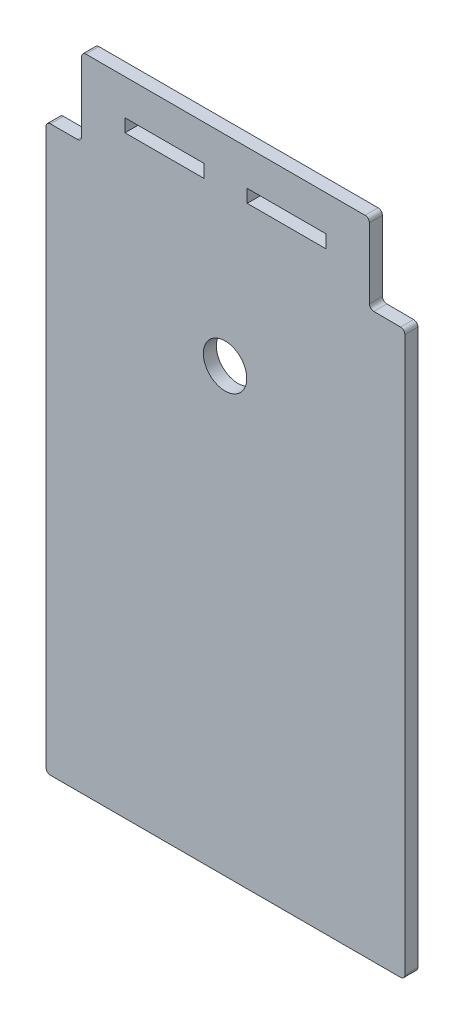
ISO-10303-21;
HEADER;
FILE_DESCRIPTION(('STEP AP214'),'2;1');
FILE_NAME('part.step','',(''),(''),'','','');
FILE_SCHEMA(('AUTOMOTIVE_DESIGN { 1 0 10303 214 1 1 1 1 }'));
ENDSEC;
DATA;
#1=APPLICATION_CONTEXT('core data for automotive mechanical design processes');
#2=APPLICATION_PROTOCOL_DEFINITION('international standard','automotive_design',2000,#1);
#3=PRODUCT_CONTEXT('',#1,'mechanical');
#4=PRODUCT('Part','Part','',(#3));
#5=PRODUCT_RELATED_PRODUCT_CATEGORY('part','',(#4));
#6=PRODUCT_DEFINITION_FORMATION('','',#4);
#7=PRODUCT_DEFINITION_CONTEXT('part definition',#1,'design');
#8=PRODUCT_DEFINITION('design','',#6,#7);
#9=PRODUCT_DEFINITION_SHAPE('','',#8);
#10=(LENGTH_UNIT() NAMED_UNIT(*) SI_UNIT(.MILLI.,.METRE.));
#11=(NAMED_UNIT(*) PLANE_ANGLE_UNIT() SI_UNIT($,.RADIAN.));
#12=(NAMED_UNIT(*) SI_UNIT($,.STERADIAN.) SOLID_ANGLE_UNIT());
#13=UNCERTAINTY_MEASURE_WITH_UNIT(LENGTH_MEASURE(1.E-05),#10,'distance_accuracy_value','');
#14=(GEOMETRIC_REPRESENTATION_CONTEXT(3) GLOBAL_UNCERTAINTY_ASSIGNED_CONTEXT((#13)) GLOBAL_UNIT_ASSIGNED_CONTEXT((#10,
#11,#12)) REPRESENTATION_CONTEXT('',''));
#15=CARTESIAN_POINT('',(0.,0.,0.));
#16=DIRECTION('',(0.,0.,1.));
#17=DIRECTION('',(1.,0.,0.));
#18=AXIS2_PLACEMENT_3D('',#15,#16,#17);
#19=CARTESIAN_POINT('',(94.9976819199968,-24.017865972816,3.));
#20=DIRECTION('',(0.,0.,1.));
#21=DIRECTION('',(1.,0.,0.));
#22=AXIS2_PLACEMENT_3D('',#19,#20,#21);
#23=PLANE('',#22);
#24=CARTESIAN_POINT('',(94.9976819199968,-24.017865972816,3.));
#25=DIRECTION('',(0.,0.,1.));
#26=DIRECTION('',(1.,0.,0.));
#27=AXIS2_PLACEMENT_3D('',#24,#25,#26);
#28=CIRCLE('',#27,1.00000000000089);
#29=CARTESIAN_POINT('',(94.9976819199977,-25.0178659728169,3.));
#30=VERTEX_POINT('',#29);
#31=CARTESIAN_POINT('',(95.9976819199977,-24.0178659728181,3.));
#32=VERTEX_POINT('',#31);
#33=EDGE_CURVE('E267',#30,#32,#28,.T.);
#34=ORIENTED_EDGE('',*,*,#33,.T.);
#35=DIRECTION('',(0.,1.,0.));
#36=VECTOR('',#35,1.);
#37=CARTESIAN_POINT('',(95.9976819199977,-24.0178659728181,3.));
#38=LINE('',#37,#36);
#39=CARTESIAN_POINT('',(95.9976819199977,103.764725177064,3.));
#40=VERTEX_POINT('',#39);
#41=EDGE_CURVE('E270',#32,#40,#38,.T.);
#42=ORIENTED_EDGE('',*,*,#41,.T.);
#43=CARTESIAN_POINT('',(94.9976957703175,103.769988298547,3.));
#44=DIRECTION('',(0.,0.,1.));
#45=DIRECTION('',(1.,0.,0.));
#46=AXIS2_PLACEMENT_3D('',#43,#44,#45);
#47=CIRCLE('',#46,0.999999999999976);
#48=CARTESIAN_POINT('',(95.002958891764,104.769974448228,3.));
#49=VERTEX_POINT('',#48);
#50=EDGE_CURVE('E273',#40,#49,#47,.T.);
#51=ORIENTED_EDGE('',*,*,#50,.T.);
#52=DIRECTION('',(-0.999986149680404,0.00526312144653535,0.));
#53=VECTOR('',#52,1.);
#54=CARTESIAN_POINT('',(88.8302671220173,104.802462524634,3.));
#55=LINE('',#54,#53);
#56=CARTESIAN_POINT('',(88.8302671220173,104.802462524634,3.));
#57=VERTEX_POINT('',#56);
#58=EDGE_CURVE('E275',#49,#57,#55,.T.);
#59=ORIENTED_EDGE('',*,*,#58,.T.);
#60=CARTESIAN_POINT('',(88.8355302434638,105.802448674315,3.));
#61=DIRECTION('',(0.,0.,-1.));
#62=DIRECTION('',(1.,0.,0.));
#63=AXIS2_PLACEMENT_3D('',#60,#61,#62);
#64=CIRCLE('',#63,1.00000000000003);
#65=CARTESIAN_POINT('',(87.8355440937833,105.807711795761,3.));
#66=VERTEX_POINT('',#65);
#67=EDGE_CURVE('E277',#57,#66,#64,.T.);
#68=ORIENTED_EDGE('',*,*,#67,.T.);
#69=DIRECTION('',(-0.000657793893112373,0.999999783653574,0.));
#70=VECTOR('',#69,1.);
#71=CARTESIAN_POINT('',(87.8249046553131,121.98213402718,3.));
#72=LINE('',#71,#70);
#73=CARTESIAN_POINT('',(87.8249046553131,121.98213402718,3.));
#74=VERTEX_POINT('',#73);
#75=EDGE_CURVE('E279',#66,#74,#72,.T.);
#76=ORIENTED_EDGE('',*,*,#75,.T.);
#77=CARTESIAN_POINT('',(86.8249046553131,121.98213402718,3.));
#78=DIRECTION('',(0.,0.,1.));
#79=DIRECTION('',(1.,0.,0.));
#80=AXIS2_PLACEMENT_3D('',#77,#78,#79);
#81=CIRCLE('',#80,1.00000000000001);
#82=CARTESIAN_POINT('',(86.8249046553131,122.98213402718,3.));
#83=VERTEX_POINT('',#82);
#84=EDGE_CURVE('E281',#74,#83,#81,.T.);
#85=ORIENTED_EDGE('',*,*,#84,.T.);
#86=DIRECTION('',(-1.,0.,0.));
#87=VECTOR('',#86,1.);
#88=CARTESIAN_POINT('',(22.4976819199977,122.98213402718,3.));
#89=LINE('',#88,#87);
#90=CARTESIAN_POINT('',(22.4976819199977,122.98213402718,3.));
#91=VERTEX_POINT('',#90);
#92=EDGE_CURVE('E283',#83,#91,#89,.T.);
#93=ORIENTED_EDGE('',*,*,#92,.T.);
#94=CARTESIAN_POINT('',(22.4976819199978,121.98213402718,3.));
#95=DIRECTION('',(0.,0.,1.));
#96=DIRECTION('',(1.,0.,0.));
#97=AXIS2_PLACEMENT_3D('',#94,#95,#96);
#98=CIRCLE('',#97,1.00000000000001);
#99=CARTESIAN_POINT('',(21.4976819199978,121.98213402718,3.));
#100=VERTEX_POINT('',#99);
#101=EDGE_CURVE('E285',#91,#100,#98,.T.);
#102=ORIENTED_EDGE('',*,*,#101,.T.);
#103=DIRECTION('',(0.,-1.,0.));
#104=VECTOR('',#103,1.);
#105=CARTESIAN_POINT('',(21.4976819199978,121.98213402718,3.));
#106=LINE('',#105,#104);
#107=CARTESIAN_POINT('',(21.4976819199978,105.982134027182,3.));
#108=VERTEX_POINT('',#107);
#109=EDGE_CURVE('E287',#100,#108,#106,.T.);
#110=ORIENTED_EDGE('',*,*,#109,.T.);
#111=CARTESIAN_POINT('',(20.4976819199978,105.982134027182,3.));
#112=DIRECTION('',(0.,0.,-1.));
#113=DIRECTION('',(1.,0.,0.));
#114=AXIS2_PLACEMENT_3D('',#111,#112,#113);
#115=CIRCLE('',#114,1.00000000000002);
#116=CARTESIAN_POINT('',(20.4976819199977,104.982134027182,3.));
#117=VERTEX_POINT('',#116);
#118=EDGE_CURVE('E289',#108,#117,#115,.T.);
#119=ORIENTED_EDGE('',*,*,#118,.T.);
#120=DIRECTION('',(-1.,0.,0.));
#121=VECTOR('',#120,1.);
#122=CARTESIAN_POINT('',(20.4976819199977,104.982134027182,3.));
#123=LINE('',#122,#121);
#124=CARTESIAN_POINT('',(14.324904655313,104.982134027182,3.));
#125=VERTEX_POINT('',#124);
#126=EDGE_CURVE('E291',#117,#125,#123,.T.);
#127=ORIENTED_EDGE('',*,*,#126,.T.);
#128=CARTESIAN_POINT('',(14.324904655313,103.982134027182,3.));
#129=DIRECTION('',(0.,0.,1.));
#130=DIRECTION('',(1.,0.,0.));
#131=AXIS2_PLACEMENT_3D('',#128,#129,#130);
#132=CIRCLE('',#131,0.999999999999973);
#133=CARTESIAN_POINT('',(13.3249046553131,103.982134027182,3.));
#134=VERTEX_POINT('',#133);
#135=EDGE_CURVE('E293',#125,#134,#132,.T.);
#136=ORIENTED_EDGE('',*,*,#135,.T.);
#137=DIRECTION('',(0.,-1.,0.));
#138=VECTOR('',#137,1.);
#139=CARTESIAN_POINT('',(13.3249046553131,103.982134027182,3.));
#140=LINE('',#139,#138);
#141=CARTESIAN_POINT('',(13.3249046553132,-24.0178659728174,3.));
#142=VERTEX_POINT('',#141);
#143=EDGE_CURVE('E295',#134,#142,#140,.T.);
#144=ORIENTED_EDGE('',*,*,#143,.T.);
#145=CARTESIAN_POINT('',(14.3249046553129,-24.0178659728171,3.));
#146=DIRECTION('',(0.,0.,1.));
#147=DIRECTION('',(1.,0.,0.));
#148=AXIS2_PLACEMENT_3D('',#145,#146,#147);
#149=CIRCLE('',#148,0.999999999999756);
#150=CARTESIAN_POINT('',(14.3249046553132,-25.0178659728169,3.));
#151=VERTEX_POINT('',#150);
#152=EDGE_CURVE('E297',#142,#151,#149,.T.);
#153=ORIENTED_EDGE('',*,*,#152,.T.);
#154=DIRECTION('',(1.,0.,0.));
#155=VECTOR('',#154,1.);
#156=CARTESIAN_POINT('',(14.3249046553132,-25.0178659728169,3.));
#157=LINE('',#156,#155);
#158=EDGE_CURVE('E299',#151,#30,#157,.T.);
#159=ORIENTED_EDGE('',*,*,#158,.T.);
#160=EDGE_LOOP('',(#34,#42,#51,#59,#68,#76,#85,#93,#102,#110,#119,#127,#136,#144,#153,#159));
#161=FACE_BOUND('',#160,.T.);
#162=CARTESIAN_POINT('',(54.5612932876554,76.7821340271825,3.));
#163=DIRECTION('',(0.,0.,1.));
#164=DIRECTION('',(1.,0.,0.));
#165=AXIS2_PLACEMENT_3D('',#162,#163,#164);
#166=CIRCLE('',#165,5.);
#167=CARTESIAN_POINT('',(59.5612932876554,76.7821340271825,3.));
#168=VERTEX_POINT('',#167);
#169=EDGE_CURVE('E261',#168,#168,#166,.T.);
#170=ORIENTED_EDGE('',*,*,#169,.F.);
#171=EDGE_LOOP('',(#170));
#172=FACE_BOUND('',#171,.T.);
#173=DIRECTION('',(0.,-1.,0.));
#174=VECTOR('',#173,1.);
#175=CARTESIAN_POINT('',(59.6612932876555,114.782134027182,3.));
#176=LINE('',#175,#174);
#177=CARTESIAN_POINT('',(59.6612932876555,114.782134027182,3.));
#178=VERTEX_POINT('',#177);
#179=CARTESIAN_POINT('',(59.6612932876553,111.782134027182,3.));
#180=VERTEX_POINT('',#179);
#181=EDGE_CURVE('E232',#178,#180,#176,.T.);
#182=ORIENTED_EDGE('',*,*,#181,.F.);
#183=DIRECTION('',(-1.,0.,0.));
#184=VECTOR('',#183,1.);
#185=CARTESIAN_POINT('',(77.8249046553131,114.782134027182,3.));
#186=LINE('',#185,#184);
#187=CARTESIAN_POINT('',(77.8249046553131,114.782134027182,3.));
#188=VERTEX_POINT('',#187);
#189=EDGE_CURVE('E230',#188,#178,#186,.T.);
#190=ORIENTED_EDGE('',*,*,#189,.F.);
#191=DIRECTION('',(0.,1.,0.));
#192=VECTOR('',#191,1.);
#193=CARTESIAN_POINT('',(77.8249046553131,111.782134027182,3.));
#194=LINE('',#193,#192);
#195=CARTESIAN_POINT('',(77.8249046553131,111.782134027182,3.));
#196=VERTEX_POINT('',#195);
#197=EDGE_CURVE('E238',#196,#188,#194,.T.);
#198=ORIENTED_EDGE('',*,*,#197,.F.);
#199=DIRECTION('',(1.,0.,0.));
#200=VECTOR('',#199,1.);
#201=CARTESIAN_POINT('',(59.6612932876553,111.782134027182,3.));
#202=LINE('',#201,#200);
#203=EDGE_CURVE('E235',#180,#196,#202,.T.);
#204=ORIENTED_EDGE('',*,*,#203,.F.);
#205=EDGE_LOOP('',(#182,#190,#198,#204));
#206=FACE_BOUND('',#205,.T.);
#207=DIRECTION('',(0.,1.,0.));
#208=VECTOR('',#207,1.);
#209=CARTESIAN_POINT('',(49.6612932876554,111.782134027182,3.));
#210=LINE('',#209,#208);
#211=CARTESIAN_POINT('',(49.6612932876554,111.782134027182,3.));
#212=VERTEX_POINT('',#211);
#213=CARTESIAN_POINT('',(49.6612932876554,114.782134027182,3.));
#214=VERTEX_POINT('',#213);
#215=EDGE_CURVE('E202',#212,#214,#210,.T.);
#216=ORIENTED_EDGE('',*,*,#215,.F.);
#217=DIRECTION('',(1.,0.,0.));
#218=VECTOR('',#217,1.);
#219=CARTESIAN_POINT('',(31.4976819199977,111.782134027182,3.));
#220=LINE('',#219,#218);
#221=CARTESIAN_POINT('',(31.4976819199977,111.782134027182,3.));
#222=VERTEX_POINT('',#221);
#223=EDGE_CURVE('E194',#222,#212,#220,.T.);
#224=ORIENTED_EDGE('',*,*,#223,.F.);
#225=DIRECTION('',(0.,-1.,0.));
#226=VECTOR('',#225,1.);
#227=CARTESIAN_POINT('',(31.4976819199977,114.782134027182,3.));
#228=LINE('',#227,#226);
#229=CARTESIAN_POINT('',(31.4976819199977,114.782134027182,3.));
#230=VERTEX_POINT('',#229);
#231=EDGE_CURVE('E216',#230,#222,#228,.T.);
#232=ORIENTED_EDGE('',*,*,#231,.F.);
#233=DIRECTION('',(-1.,0.,0.));
#234=VECTOR('',#233,1.);
#235=CARTESIAN_POINT('',(49.6612932876554,114.782134027182,3.));
#236=LINE('',#235,#234);
#237=EDGE_CURVE('E214',#214,#230,#236,.T.);
#238=ORIENTED_EDGE('',*,*,#237,.F.);
#239=EDGE_LOOP('',(#216,#224,#232,#238));
#240=FACE_BOUND('',#239,.T.);
#241=ADVANCED_FACE('F33',(#161,#172,#206,#240),#23,.T.);
#242=CARTESIAN_POINT('',(94.9976819199968,-24.017865972816,0.));
#243=DIRECTION('',(0.,0.,1.));
#244=DIRECTION('',(1.,0.,0.));
#245=AXIS2_PLACEMENT_3D('',#242,#243,#244);
#246=PLANE('',#245);
#247=DIRECTION('',(-1.,0.,0.));
#248=VECTOR('',#247,1.);
#249=CARTESIAN_POINT('',(77.8249046553131,114.782134027182,0.));
#250=LINE('',#249,#248);
#251=CARTESIAN_POINT('',(77.8249046553131,114.782134027182,0.));
#252=VERTEX_POINT('',#251);
#253=CARTESIAN_POINT('',(59.6612932876555,114.782134027182,0.));
#254=VERTEX_POINT('',#253);
#255=EDGE_CURVE('E210',#252,#254,#250,.T.);
#256=ORIENTED_EDGE('',*,*,#255,.T.);
#257=DIRECTION('',(0.,-1.,0.));
#258=VECTOR('',#257,1.);
#259=CARTESIAN_POINT('',(59.6612932876555,114.782134027182,0.));
#260=LINE('',#259,#258);
#261=CARTESIAN_POINT('',(59.6612932876553,111.782134027182,0.));
#262=VERTEX_POINT('',#261);
#263=EDGE_CURVE('E243',#254,#262,#260,.T.);
#264=ORIENTED_EDGE('',*,*,#263,.T.);
#265=DIRECTION('',(1.,0.,0.));
#266=VECTOR('',#265,1.);
#267=CARTESIAN_POINT('',(59.6612932876553,111.782134027182,0.));
#268=LINE('',#267,#266);
#269=CARTESIAN_POINT('',(77.8249046553131,111.782134027182,0.));
#270=VERTEX_POINT('',#269);
#271=EDGE_CURVE('E246',#262,#270,#268,.T.);
#272=ORIENTED_EDGE('',*,*,#271,.T.);
#273=DIRECTION('',(0.,1.,0.));
#274=VECTOR('',#273,1.);
#275=CARTESIAN_POINT('',(77.8249046553131,111.782134027182,0.));
#276=LINE('',#275,#274);
#277=EDGE_CURVE('E233',#270,#252,#276,.T.);
#278=ORIENTED_EDGE('',*,*,#277,.T.);
#279=EDGE_LOOP('',(#256,#264,#272,#278));
#280=FACE_BOUND('',#279,.T.);
#281=CARTESIAN_POINT('',(94.9976819199968,-24.017865972816,0.));
#282=DIRECTION('',(0.,0.,1.));
#283=DIRECTION('',(1.,0.,0.));
#284=AXIS2_PLACEMENT_3D('',#281,#282,#283);
#285=CIRCLE('',#284,1.00000000000089);
#286=CARTESIAN_POINT('',(94.9976819199977,-25.0178659728169,0.));
#287=VERTEX_POINT('',#286);
#288=CARTESIAN_POINT('',(95.9976819199977,-24.0178659728181,0.));
#289=VERTEX_POINT('',#288);
#290=EDGE_CURVE('E264',#287,#289,#285,.T.);
#291=ORIENTED_EDGE('',*,*,#290,.F.);
#292=DIRECTION('',(1.,0.,0.));
#293=VECTOR('',#292,1.);
#294=CARTESIAN_POINT('',(14.3249046553132,-25.0178659728169,0.));
#295=LINE('',#294,#293);
#296=CARTESIAN_POINT('',(14.3249046553132,-25.0178659728169,0.));
#297=VERTEX_POINT('',#296);
#298=EDGE_CURVE('E271',#297,#287,#295,.T.);
#299=ORIENTED_EDGE('',*,*,#298,.F.);
#300=CARTESIAN_POINT('',(14.3249046553129,-24.0178659728171,0.));
#301=DIRECTION('',(0.,0.,1.));
#302=DIRECTION('',(1.,0.,0.));
#303=AXIS2_PLACEMENT_3D('',#300,#301,#302);
#304=CIRCLE('',#303,0.999999999999756);
#305=CARTESIAN_POINT('',(13.3249046553132,-24.0178659728174,0.));
#306=VERTEX_POINT('',#305);
#307=EDGE_CURVE('E331',#306,#297,#304,.T.);
#308=ORIENTED_EDGE('',*,*,#307,.F.);
#309=DIRECTION('',(0.,-1.,0.));
#310=VECTOR('',#309,1.);
#311=CARTESIAN_POINT('',(13.3249046553132,21.2979443026875,0.));
#312=LINE('',#311,#310);
#313=CARTESIAN_POINT('',(13.3249046553131,103.982134027182,0.));
#314=VERTEX_POINT('',#313);
#315=EDGE_CURVE('E329',#314,#306,#312,.T.);
#316=ORIENTED_EDGE('',*,*,#315,.F.);
#317=CARTESIAN_POINT('',(14.324904655313,103.982134027182,0.));
#318=DIRECTION('',(0.,0.,1.));
#319=DIRECTION('',(1.,0.,0.));
#320=AXIS2_PLACEMENT_3D('',#317,#318,#319);
#321=CIRCLE('',#320,0.999999999999973);
#322=CARTESIAN_POINT('',(14.324904655313,104.982134027182,0.));
#323=VERTEX_POINT('',#322);
#324=EDGE_CURVE('E326',#323,#314,#321,.T.);
#325=ORIENTED_EDGE('',*,*,#324,.F.);
#326=DIRECTION('',(-1.,0.,0.));
#327=VECTOR('',#326,1.);
#328=CARTESIAN_POINT('',(20.4976819199977,104.982134027182,0.));
#329=LINE('',#328,#327);
#330=CARTESIAN_POINT('',(20.4976819199977,104.982134027182,0.));
#331=VERTEX_POINT('',#330);
#332=EDGE_CURVE('E324',#331,#323,#329,.T.);
#333=ORIENTED_EDGE('',*,*,#332,.F.);
#334=CARTESIAN_POINT('',(20.4976819199978,105.982134027182,0.));
#335=DIRECTION('',(0.,0.,-1.));
#336=DIRECTION('',(1.,0.,0.));
#337=AXIS2_PLACEMENT_3D('',#334,#335,#336);
#338=CIRCLE('',#337,1.00000000000002);
#339=CARTESIAN_POINT('',(21.4976819199978,105.982134027182,0.));
#340=VERTEX_POINT('',#339);
#341=EDGE_CURVE('E322',#340,#331,#338,.T.);
#342=ORIENTED_EDGE('',*,*,#341,.F.);
#343=DIRECTION('',(0.,-1.,0.));
#344=VECTOR('',#343,1.);
#345=CARTESIAN_POINT('',(21.4976819199978,121.98213402718,0.));
#346=LINE('',#345,#344);
#347=CARTESIAN_POINT('',(21.4976819199978,121.98213402718,0.));
#348=VERTEX_POINT('',#347);
#349=EDGE_CURVE('E320',#348,#340,#346,.T.);
#350=ORIENTED_EDGE('',*,*,#349,.F.);
#351=CARTESIAN_POINT('',(22.4976819199978,121.98213402718,0.));
#352=DIRECTION('',(0.,0.,1.));
#353=DIRECTION('',(1.,0.,0.));
#354=AXIS2_PLACEMENT_3D('',#351,#352,#353);
#355=CIRCLE('',#354,1.00000000000001);
#356=CARTESIAN_POINT('',(22.4976819199977,122.98213402718,0.));
#357=VERTEX_POINT('',#356);
#358=EDGE_CURVE('E318',#357,#348,#355,.T.);
#359=ORIENTED_EDGE('',*,*,#358,.F.);
#360=DIRECTION('',(-1.,0.,0.));
#361=VECTOR('',#360,1.);
#362=CARTESIAN_POINT('',(22.4976819199977,122.98213402718,0.));
#363=LINE('',#362,#361);
#364=CARTESIAN_POINT('',(86.8249046553131,122.98213402718,0.));
#365=VERTEX_POINT('',#364);
#366=EDGE_CURVE('E316',#365,#357,#363,.T.);
#367=ORIENTED_EDGE('',*,*,#366,.F.);
#368=CARTESIAN_POINT('',(86.8249046553131,121.98213402718,0.));
#369=DIRECTION('',(0.,0.,1.));
#370=DIRECTION('',(1.,0.,0.));
#371=AXIS2_PLACEMENT_3D('',#368,#369,#370);
#372=CIRCLE('',#371,1.00000000000001);
#373=CARTESIAN_POINT('',(87.8249046553131,121.98213402718,0.));
#374=VERTEX_POINT('',#373);
#375=EDGE_CURVE('E314',#374,#365,#372,.T.);
#376=ORIENTED_EDGE('',*,*,#375,.F.);
#377=DIRECTION('',(-0.000657793893112373,0.999999783653574,0.));
#378=VECTOR('',#377,1.);
#379=CARTESIAN_POINT('',(87.8249046553131,121.98213402718,0.));
#380=LINE('',#379,#378);
#381=CARTESIAN_POINT('',(87.8355440937833,105.807711795761,0.));
#382=VERTEX_POINT('',#381);
#383=EDGE_CURVE('E312',#382,#374,#380,.T.);
#384=ORIENTED_EDGE('',*,*,#383,.F.);
#385=CARTESIAN_POINT('',(88.8355302434638,105.802448674315,0.));
#386=DIRECTION('',(0.,0.,-1.));
#387=DIRECTION('',(1.,0.,0.));
#388=AXIS2_PLACEMENT_3D('',#385,#386,#387);
#389=CIRCLE('',#388,1.00000000000003);
#390=CARTESIAN_POINT('',(88.8302671220173,104.802462524634,0.));
#391=VERTEX_POINT('',#390);
#392=EDGE_CURVE('E310',#391,#382,#389,.T.);
#393=ORIENTED_EDGE('',*,*,#392,.F.);
#394=DIRECTION('',(-0.999986149680404,0.00526312144653535,0.));
#395=VECTOR('',#394,1.);
#396=CARTESIAN_POINT('',(88.8302671220173,104.802462524634,0.));
#397=LINE('',#396,#395);
#398=CARTESIAN_POINT('',(95.002958891764,104.769974448228,0.));
#399=VERTEX_POINT('',#398);
#400=EDGE_CURVE('E308',#399,#391,#397,.T.);
#401=ORIENTED_EDGE('',*,*,#400,.F.);
#402=CARTESIAN_POINT('',(94.9976957703175,103.769988298547,0.));
#403=DIRECTION('',(0.,0.,1.));
#404=DIRECTION('',(1.,0.,0.));
#405=AXIS2_PLACEMENT_3D('',#402,#403,#404);
#406=CIRCLE('',#405,0.999999999999976);
#407=CARTESIAN_POINT('',(95.9976819199977,103.764725177064,0.));
#408=VERTEX_POINT('',#407);
#409=EDGE_CURVE('E306',#408,#399,#406,.T.);
#410=ORIENTED_EDGE('',*,*,#409,.F.);
#411=DIRECTION('',(0.,1.,0.));
#412=VECTOR('',#411,1.);
#413=CARTESIAN_POINT('',(95.9976819199977,-24.0178659728181,0.));
#414=LINE('',#413,#412);
#415=EDGE_CURVE('E304',#289,#408,#414,.T.);
#416=ORIENTED_EDGE('',*,*,#415,.F.);
#417=EDGE_LOOP('',(#291,#299,#308,#316,#325,#333,#342,#350,#359,#367,#376,#384,#393,#401,#410,#416));
#418=FACE_BOUND('',#417,.T.);
#419=CARTESIAN_POINT('',(54.5612932876554,76.7821340271825,0.));
#420=DIRECTION('',(0.,0.,1.));
#421=DIRECTION('',(1.,0.,0.));
#422=AXIS2_PLACEMENT_3D('',#419,#420,#421);
#423=CIRCLE('',#422,5.);
#424=CARTESIAN_POINT('',(59.5612932876554,76.7821340271825,0.));
#425=VERTEX_POINT('',#424);
#426=EDGE_CURVE('E260',#425,#425,#423,.T.);
#427=ORIENTED_EDGE('',*,*,#426,.T.);
#428=EDGE_LOOP('',(#427));
#429=FACE_BOUND('',#428,.T.);
#430=DIRECTION('',(1.,0.,0.));
#431=VECTOR('',#430,1.);
#432=CARTESIAN_POINT('',(31.4976819199977,111.782134027182,0.));
#433=LINE('',#432,#431);
#434=CARTESIAN_POINT('',(31.4976819199977,111.782134027182,0.));
#435=VERTEX_POINT('',#434);
#436=CARTESIAN_POINT('',(49.6612932876554,111.782134027182,0.));
#437=VERTEX_POINT('',#436);
#438=EDGE_CURVE('E56',#435,#437,#433,.T.);
#439=ORIENTED_EDGE('',*,*,#438,.T.);
#440=DIRECTION('',(0.,1.,0.));
#441=VECTOR('',#440,1.);
#442=CARTESIAN_POINT('',(49.6612932876554,111.782134027182,0.));
#443=LINE('',#442,#441);
#444=CARTESIAN_POINT('',(49.6612932876554,114.782134027182,0.));
#445=VERTEX_POINT('',#444);
#446=EDGE_CURVE('E209',#437,#445,#443,.T.);
#447=ORIENTED_EDGE('',*,*,#446,.T.);
#448=DIRECTION('',(-1.,0.,0.));
#449=VECTOR('',#448,1.);
#450=CARTESIAN_POINT('',(49.6612932876554,114.782134027182,0.));
#451=LINE('',#450,#449);
#452=CARTESIAN_POINT('',(31.4976819199977,114.782134027182,0.));
#453=VERTEX_POINT('',#452);
#454=EDGE_CURVE('E222',#445,#453,#451,.T.);
#455=ORIENTED_EDGE('',*,*,#454,.T.);
#456=DIRECTION('',(0.,-1.,0.));
#457=VECTOR('',#456,1.);
#458=CARTESIAN_POINT('',(31.4976819199977,114.782134027182,0.));
#459=LINE('',#458,#457);
#460=EDGE_CURVE('E203',#453,#435,#459,.T.);
#461=ORIENTED_EDGE('',*,*,#460,.T.);
#462=EDGE_LOOP('',(#439,#447,#455,#461));
#463=FACE_BOUND('',#462,.T.);
#464=ADVANCED_FACE('F385',(#280,#418,#429,#463),#246,.F.);
#465=CARTESIAN_POINT('',(94.9976819199968,-24.017865972816,3.));
#466=DIRECTION('',(0.,0.,-1.));
#467=DIRECTION('',(-1.,0.,0.));
#468=AXIS2_PLACEMENT_3D('',#465,#466,#467);
#469=CYLINDRICAL_SURFACE('',#468,1.00000000000089);
#470=ORIENTED_EDGE('',*,*,#290,.T.);
#471=DIRECTION('',(0.,0.,-1.));
#472=VECTOR('',#471,1.);
#473=CARTESIAN_POINT('',(95.9976819199977,-24.0178659728181,3.));
#474=LINE('',#473,#472);
#475=EDGE_CURVE('E11',#32,#289,#474,.T.);
#476=ORIENTED_EDGE('',*,*,#475,.F.);
#477=ORIENTED_EDGE('',*,*,#33,.F.);
#478=DIRECTION('',(0.,0.,-1.));
#479=VECTOR('',#478,1.);
#480=CARTESIAN_POINT('',(94.9976819199977,-25.0178659728169,3.));
#481=LINE('',#480,#479);
#482=EDGE_CURVE('E301',#30,#287,#481,.T.);
#483=ORIENTED_EDGE('',*,*,#482,.T.);
#484=EDGE_LOOP('',(#470,#476,#477,#483));
#485=FACE_BOUND('',#484,.T.);
#486=ADVANCED_FACE('F35',(#485),#469,.T.);
#487=CARTESIAN_POINT('',(95.9976819199977,-24.0178659728181,3.));
#488=DIRECTION('',(-1.,0.,0.));
#489=DIRECTION('',(0.,-1.,0.));
#490=AXIS2_PLACEMENT_3D('',#487,#488,#489);
#491=PLANE('',#490);
#492=ORIENTED_EDGE('',*,*,#415,.T.);
#493=DIRECTION('',(0.,0.,-1.));
#494=VECTOR('',#493,1.);
#495=CARTESIAN_POINT('',(95.9976819199977,103.764725177064,3.));
#496=LINE('',#495,#494);
#497=EDGE_CURVE('E41',#40,#408,#496,.T.);
#498=ORIENTED_EDGE('',*,*,#497,.F.);
#499=ORIENTED_EDGE('',*,*,#41,.F.);
#500=ORIENTED_EDGE('',*,*,#475,.T.);
#501=EDGE_LOOP('',(#492,#498,#499,#500));
#502=FACE_BOUND('',#501,.T.);
#503=ADVANCED_FACE('F403',(#502),#491,.F.);
#504=CARTESIAN_POINT('',(94.9976957703175,103.769988298547,3.));
#505=DIRECTION('',(0.,0.,-1.));
#506=DIRECTION('',(-1.,0.,0.));
#507=AXIS2_PLACEMENT_3D('',#504,#505,#506);
#508=CYLINDRICAL_SURFACE('',#507,0.999999999999976);
#509=ORIENTED_EDGE('',*,*,#409,.T.);
#510=DIRECTION('',(0.,0.,-1.));
#511=VECTOR('',#510,1.);
#512=CARTESIAN_POINT('',(95.002958891764,104.769974448228,3.));
#513=LINE('',#512,#511);
#514=EDGE_CURVE('E372',#49,#399,#513,.T.);
#515=ORIENTED_EDGE('',*,*,#514,.F.);
#516=ORIENTED_EDGE('',*,*,#50,.F.);
#517=ORIENTED_EDGE('',*,*,#497,.T.);
#518=EDGE_LOOP('',(#509,#515,#516,#517));
#519=FACE_BOUND('',#518,.T.);
#520=ADVANCED_FACE('F379',(#519),#508,.T.);
#521=CARTESIAN_POINT('',(88.8302671220173,104.802462524634,3.));
#522=DIRECTION('',(-0.00526312144653535,-0.999986149680404,0.));
#523=DIRECTION('',(0.999986149680404,-0.00526312144653535,0.));
#524=AXIS2_PLACEMENT_3D('',#521,#522,#523);
#525=PLANE('',#524);
#526=ORIENTED_EDGE('',*,*,#400,.T.);
#527=DIRECTION('',(0.,0.,-1.));
#528=VECTOR('',#527,1.);
#529=CARTESIAN_POINT('',(88.8302671220173,104.802462524634,3.));
#530=LINE('',#529,#528);
#531=EDGE_CURVE('E369',#57,#391,#530,.T.);
#532=ORIENTED_EDGE('',*,*,#531,.F.);
#533=ORIENTED_EDGE('',*,*,#58,.F.);
#534=ORIENTED_EDGE('',*,*,#514,.T.);
#535=EDGE_LOOP('',(#526,#532,#533,#534));
#536=FACE_BOUND('',#535,.T.);
#537=ADVANCED_FACE('F391',(#536),#525,.F.);
#538=CARTESIAN_POINT('',(88.8355302434638,105.802448674315,3.));
#539=DIRECTION('',(0.,0.,-1.));
#540=DIRECTION('',(-1.,0.,0.));
#541=AXIS2_PLACEMENT_3D('',#538,#539,#540);
#542=CYLINDRICAL_SURFACE('',#541,1.00000000000003);
#543=ORIENTED_EDGE('',*,*,#392,.T.);
#544=DIRECTION('',(0.,0.,-1.));
#545=VECTOR('',#544,1.);
#546=CARTESIAN_POINT('',(87.8355440937833,105.807711795761,3.));
#547=LINE('',#546,#545);
#548=EDGE_CURVE('E366',#66,#382,#547,.T.);
#549=ORIENTED_EDGE('',*,*,#548,.F.);
#550=ORIENTED_EDGE('',*,*,#67,.F.);
#551=ORIENTED_EDGE('',*,*,#531,.T.);
#552=EDGE_LOOP('',(#543,#549,#550,#551));
#553=FACE_BOUND('',#552,.T.);
#554=ADVANCED_FACE('F395',(#553),#542,.F.);
#555=CARTESIAN_POINT('',(87.8249046553131,121.98213402718,3.));
#556=DIRECTION('',(-0.999999783653574,-0.000657793893112373,0.));
#557=DIRECTION('',(0.000657793893112373,-0.999999783653574,0.));
#558=AXIS2_PLACEMENT_3D('',#555,#556,#557);
#559=PLANE('',#558);
#560=ORIENTED_EDGE('',*,*,#383,.T.);
#561=DIRECTION('',(0.,0.,-1.));
#562=VECTOR('',#561,1.);
#563=CARTESIAN_POINT('',(87.8249046553131,121.98213402718,3.));
#564=LINE('',#563,#562);
#565=EDGE_CURVE('E363',#74,#374,#564,.T.);
#566=ORIENTED_EDGE('',*,*,#565,.F.);
#567=ORIENTED_EDGE('',*,*,#75,.F.);
#568=ORIENTED_EDGE('',*,*,#548,.T.);
#569=EDGE_LOOP('',(#560,#566,#567,#568));
#570=FACE_BOUND('',#569,.T.);
#571=ADVANCED_FACE('F455',(#570),#559,.F.);
#572=CARTESIAN_POINT('',(86.8249046553131,121.98213402718,3.));
#573=DIRECTION('',(0.,0.,-1.));
#574=DIRECTION('',(-1.,0.,0.));
#575=AXIS2_PLACEMENT_3D('',#572,#573,#574);
#576=CYLINDRICAL_SURFACE('',#575,1.00000000000001);
#577=ORIENTED_EDGE('',*,*,#375,.T.);
#578=DIRECTION('',(0.,0.,-1.));
#579=VECTOR('',#578,1.);
#580=CARTESIAN_POINT('',(86.8249046553131,122.98213402718,3.));
#581=LINE('',#580,#579);
#582=EDGE_CURVE('E360',#83,#365,#581,.T.);
#583=ORIENTED_EDGE('',*,*,#582,.F.);
#584=ORIENTED_EDGE('',*,*,#84,.F.);
#585=ORIENTED_EDGE('',*,*,#565,.T.);
#586=EDGE_LOOP('',(#577,#583,#584,#585));
#587=FACE_BOUND('',#586,.T.);
#588=ADVANCED_FACE('F453',(#587),#576,.T.);
#589=CARTESIAN_POINT('',(22.4976819199977,122.98213402718,3.));
#590=DIRECTION('',(0.,-1.,0.));
#591=DIRECTION('',(1.,0.,0.));
#592=AXIS2_PLACEMENT_3D('',#589,#590,#591);
#593=PLANE('',#592);
#594=ORIENTED_EDGE('',*,*,#366,.T.);
#595=DIRECTION('',(0.,0.,-1.));
#596=VECTOR('',#595,1.);
#597=CARTESIAN_POINT('',(22.4976819199977,122.98213402718,3.));
#598=LINE('',#597,#596);
#599=EDGE_CURVE('E357',#91,#357,#598,.T.);
#600=ORIENTED_EDGE('',*,*,#599,.F.);
#601=ORIENTED_EDGE('',*,*,#92,.F.);
#602=ORIENTED_EDGE('',*,*,#582,.T.);
#603=EDGE_LOOP('',(#594,#600,#601,#602));
#604=FACE_BOUND('',#603,.T.);
#605=ADVANCED_FACE('F448',(#604),#593,.F.);
#606=CARTESIAN_POINT('',(22.4976819199978,121.98213402718,3.));
#607=DIRECTION('',(0.,0.,-1.));
#608=DIRECTION('',(-1.,0.,0.));
#609=AXIS2_PLACEMENT_3D('',#606,#607,#608);
#610=CYLINDRICAL_SURFACE('',#609,1.00000000000001);
#611=ORIENTED_EDGE('',*,*,#358,.T.);
#612=DIRECTION('',(0.,0.,-1.));
#613=VECTOR('',#612,1.);
#614=CARTESIAN_POINT('',(21.4976819199978,121.98213402718,3.));
#615=LINE('',#614,#613);
#616=EDGE_CURVE('E354',#100,#348,#615,.T.);
#617=ORIENTED_EDGE('',*,*,#616,.F.);
#618=ORIENTED_EDGE('',*,*,#101,.F.);
#619=ORIENTED_EDGE('',*,*,#599,.T.);
#620=EDGE_LOOP('',(#611,#617,#618,#619));
#621=FACE_BOUND('',#620,.T.);
#622=ADVANCED_FACE('F443',(#621),#610,.T.);
#623=CARTESIAN_POINT('',(21.4976819199978,121.98213402718,3.));
#624=DIRECTION('',(1.,0.,0.));
#625=DIRECTION('',(0.,1.,0.));
#626=AXIS2_PLACEMENT_3D('',#623,#624,#625);
#627=PLANE('',#626);
#628=ORIENTED_EDGE('',*,*,#349,.T.);
#629=DIRECTION('',(0.,0.,-1.));
#630=VECTOR('',#629,1.);
#631=CARTESIAN_POINT('',(21.4976819199978,105.982134027182,3.));
#632=LINE('',#631,#630);
#633=EDGE_CURVE('E351',#108,#340,#632,.T.);
#634=ORIENTED_EDGE('',*,*,#633,.F.);
#635=ORIENTED_EDGE('',*,*,#109,.F.);
#636=ORIENTED_EDGE('',*,*,#616,.T.);
#637=EDGE_LOOP('',(#628,#634,#635,#636));
#638=FACE_BOUND('',#637,.T.);
#639=ADVANCED_FACE('F439',(#638),#627,.F.);
#640=CARTESIAN_POINT('',(20.4976819199978,105.982134027182,3.));
#641=DIRECTION('',(0.,0.,-1.));
#642=DIRECTION('',(-1.,0.,0.));
#643=AXIS2_PLACEMENT_3D('',#640,#641,#642);
#644=CYLINDRICAL_SURFACE('',#643,1.00000000000002);
#645=ORIENTED_EDGE('',*,*,#341,.T.);
#646=DIRECTION('',(0.,0.,-1.));
#647=VECTOR('',#646,1.);
#648=CARTESIAN_POINT('',(20.4976819199977,104.982134027182,3.));
#649=LINE('',#648,#647);
#650=EDGE_CURVE('E348',#117,#331,#649,.T.);
#651=ORIENTED_EDGE('',*,*,#650,.F.);
#652=ORIENTED_EDGE('',*,*,#118,.F.);
#653=ORIENTED_EDGE('',*,*,#633,.T.);
#654=EDGE_LOOP('',(#645,#651,#652,#653));
#655=FACE_BOUND('',#654,.T.);
#656=ADVANCED_FACE('F434',(#655),#644,.F.);
#657=CARTESIAN_POINT('',(20.4976819199977,104.982134027182,3.));
#658=DIRECTION('',(0.,-1.,0.));
#659=DIRECTION('',(1.,0.,0.));
#660=AXIS2_PLACEMENT_3D('',#657,#658,#659);
#661=PLANE('',#660);
#662=ORIENTED_EDGE('',*,*,#332,.T.);
#663=DIRECTION('',(0.,0.,-1.));
#664=VECTOR('',#663,1.);
#665=CARTESIAN_POINT('',(14.324904655313,104.982134027182,3.));
#666=LINE('',#665,#664);
#667=EDGE_CURVE('E345',#125,#323,#666,.T.);
#668=ORIENTED_EDGE('',*,*,#667,.F.);
#669=ORIENTED_EDGE('',*,*,#126,.F.);
#670=ORIENTED_EDGE('',*,*,#650,.T.);
#671=EDGE_LOOP('',(#662,#668,#669,#670));
#672=FACE_BOUND('',#671,.T.);
#673=ADVANCED_FACE('F428',(#672),#661,.F.);
#674=CARTESIAN_POINT('',(14.324904655313,103.982134027182,3.));
#675=DIRECTION('',(0.,0.,-1.));
#676=DIRECTION('',(-1.,0.,0.));
#677=AXIS2_PLACEMENT_3D('',#674,#675,#676);
#678=CYLINDRICAL_SURFACE('',#677,0.999999999999973);
#679=ORIENTED_EDGE('',*,*,#324,.T.);
#680=DIRECTION('',(0.,0.,-1.));
#681=VECTOR('',#680,1.);
#682=CARTESIAN_POINT('',(13.3249046553131,103.982134027182,3.));
#683=LINE('',#682,#681);
#684=EDGE_CURVE('E342',#134,#314,#683,.T.);
#685=ORIENTED_EDGE('',*,*,#684,.F.);
#686=ORIENTED_EDGE('',*,*,#135,.F.);
#687=ORIENTED_EDGE('',*,*,#667,.T.);
#688=EDGE_LOOP('',(#679,#685,#686,#687));
#689=FACE_BOUND('',#688,.T.);
#690=ADVANCED_FACE('F423',(#689),#678,.T.);
#691=CARTESIAN_POINT('',(13.3249046553132,21.2979443026875,3.));
#692=DIRECTION('',(1.,0.,0.));
#693=DIRECTION('',(0.,0.,-1.));
#694=AXIS2_PLACEMENT_3D('',#691,#692,#693);
#695=PLANE('',#694);
#696=ORIENTED_EDGE('',*,*,#315,.T.);
#697=DIRECTION('',(0.,0.,-1.));
#698=VECTOR('',#697,1.);
#699=CARTESIAN_POINT('',(13.3249046553132,-24.0178659728174,3.));
#700=LINE('',#699,#698);
#701=EDGE_CURVE('E339',#142,#306,#700,.T.);
#702=ORIENTED_EDGE('',*,*,#701,.F.);
#703=ORIENTED_EDGE('',*,*,#143,.F.);
#704=ORIENTED_EDGE('',*,*,#684,.T.);
#705=EDGE_LOOP('',(#696,#702,#703,#704));
#706=FACE_BOUND('',#705,.T.);
#707=ADVANCED_FACE('F418',(#706),#695,.F.);
#708=CARTESIAN_POINT('',(14.3249046553129,-24.0178659728171,3.));
#709=DIRECTION('',(0.,0.,-1.));
#710=DIRECTION('',(-1.,0.,0.));
#711=AXIS2_PLACEMENT_3D('',#708,#709,#710);
#712=CYLINDRICAL_SURFACE('',#711,0.999999999999756);
#713=ORIENTED_EDGE('',*,*,#307,.T.);
#714=DIRECTION('',(0.,0.,-1.));
#715=VECTOR('',#714,1.);
#716=CARTESIAN_POINT('',(14.3249046553132,-25.0178659728169,3.));
#717=LINE('',#716,#715);
#718=EDGE_CURVE('E336',#151,#297,#717,.T.);
#719=ORIENTED_EDGE('',*,*,#718,.F.);
#720=ORIENTED_EDGE('',*,*,#152,.F.);
#721=ORIENTED_EDGE('',*,*,#701,.T.);
#722=EDGE_LOOP('',(#713,#719,#720,#721));
#723=FACE_BOUND('',#722,.T.);
#724=ADVANCED_FACE('F414',(#723),#712,.T.);
#725=CARTESIAN_POINT('',(14.3249046553132,-25.0178659728169,3.));
#726=DIRECTION('',(0.,1.,0.));
#727=DIRECTION('',(0.,0.,1.));
#728=AXIS2_PLACEMENT_3D('',#725,#726,#727);
#729=PLANE('',#728);
#730=ORIENTED_EDGE('',*,*,#298,.T.);
#731=ORIENTED_EDGE('',*,*,#482,.F.);
#732=ORIENTED_EDGE('',*,*,#158,.F.);
#733=ORIENTED_EDGE('',*,*,#718,.T.);
#734=EDGE_LOOP('',(#730,#731,#732,#733));
#735=FACE_BOUND('',#734,.T.);
#736=ADVANCED_FACE('F409',(#735),#729,.F.);
#737=CARTESIAN_POINT('',(54.5612932876554,76.7821340271825,3.));
#738=DIRECTION('',(0.,0.,-1.));
#739=DIRECTION('',(-1.,0.,0.));
#740=AXIS2_PLACEMENT_3D('',#737,#738,#739);
#741=CYLINDRICAL_SURFACE('',#740,5.);
#742=ORIENTED_EDGE('',*,*,#169,.T.);
#743=EDGE_LOOP('',(#742));
#744=FACE_BOUND('',#743,.T.);
#745=ORIENTED_EDGE('',*,*,#426,.F.);
#746=EDGE_LOOP('',(#745));
#747=FACE_BOUND('',#746,.T.);
#748=ADVANCED_FACE('F472',(#744,#747),#741,.F.);
#749=CARTESIAN_POINT('',(77.8249046553131,114.782134027182,3.));
#750=DIRECTION('',(0.,-1.,0.));
#751=DIRECTION('',(1.,0.,0.));
#752=AXIS2_PLACEMENT_3D('',#749,#750,#751);
#753=PLANE('',#752);
#754=ORIENTED_EDGE('',*,*,#255,.F.);
#755=DIRECTION('',(0.,0.,-1.));
#756=VECTOR('',#755,1.);
#757=CARTESIAN_POINT('',(77.8249046553131,114.782134027182,3.));
#758=LINE('',#757,#756);
#759=EDGE_CURVE('E240',#188,#252,#758,.T.);
#760=ORIENTED_EDGE('',*,*,#759,.F.);
#761=ORIENTED_EDGE('',*,*,#189,.T.);
#762=DIRECTION('',(0.,0.,-1.));
#763=VECTOR('',#762,1.);
#764=CARTESIAN_POINT('',(59.6612932876555,114.782134027182,3.));
#765=LINE('',#764,#763);
#766=EDGE_CURVE('E257',#178,#254,#765,.T.);
#767=ORIENTED_EDGE('',*,*,#766,.T.);
#768=EDGE_LOOP('',(#754,#760,#761,#767));
#769=FACE_BOUND('',#768,.T.);
#770=ADVANCED_FACE('F534',(#769),#753,.T.);
#771=CARTESIAN_POINT('',(59.6612932876555,114.782134027182,3.));
#772=DIRECTION('',(1.,0.,0.));
#773=DIRECTION('',(0.,1.,0.));
#774=AXIS2_PLACEMENT_3D('',#771,#772,#773);
#775=PLANE('',#774);
#776=ORIENTED_EDGE('',*,*,#263,.F.);
#777=ORIENTED_EDGE('',*,*,#766,.F.);
#778=ORIENTED_EDGE('',*,*,#181,.T.);
#779=DIRECTION('',(0.,0.,-1.));
#780=VECTOR('',#779,1.);
#781=CARTESIAN_POINT('',(59.6612932876553,111.782134027182,3.));
#782=LINE('',#781,#780);
#783=EDGE_CURVE('E255',#180,#262,#782,.T.);
#784=ORIENTED_EDGE('',*,*,#783,.T.);
#785=EDGE_LOOP('',(#776,#777,#778,#784));
#786=FACE_BOUND('',#785,.T.);
#787=ADVANCED_FACE('F541',(#786),#775,.T.);
#788=CARTESIAN_POINT('',(59.6612932876553,111.782134027182,3.));
#789=DIRECTION('',(0.,1.,0.));
#790=DIRECTION('',(-1.,0.,0.));
#791=AXIS2_PLACEMENT_3D('',#788,#789,#790);
#792=PLANE('',#791);
#793=ORIENTED_EDGE('',*,*,#271,.F.);
#794=ORIENTED_EDGE('',*,*,#783,.F.);
#795=ORIENTED_EDGE('',*,*,#203,.T.);
#796=DIRECTION('',(0.,0.,-1.));
#797=VECTOR('',#796,1.);
#798=CARTESIAN_POINT('',(77.8249046553131,111.782134027182,3.));
#799=LINE('',#798,#797);
#800=EDGE_CURVE('E253',#196,#270,#799,.T.);
#801=ORIENTED_EDGE('',*,*,#800,.T.);
#802=EDGE_LOOP('',(#793,#794,#795,#801));
#803=FACE_BOUND('',#802,.T.);
#804=ADVANCED_FACE('F548',(#803),#792,.T.);
#805=CARTESIAN_POINT('',(77.8249046553131,111.782134027182,3.));
#806=DIRECTION('',(-1.,0.,0.));
#807=DIRECTION('',(0.,-1.,0.));
#808=AXIS2_PLACEMENT_3D('',#805,#806,#807);
#809=PLANE('',#808);
#810=ORIENTED_EDGE('',*,*,#277,.F.);
#811=ORIENTED_EDGE('',*,*,#800,.F.);
#812=ORIENTED_EDGE('',*,*,#197,.T.);
#813=ORIENTED_EDGE('',*,*,#759,.T.);
#814=EDGE_LOOP('',(#810,#811,#812,#813));
#815=FACE_BOUND('',#814,.T.);
#816=ADVANCED_FACE('F556',(#815),#809,.T.);
#817=CARTESIAN_POINT('',(31.4976819199977,111.782134027182,3.));
#818=DIRECTION('',(0.,1.,0.));
#819=DIRECTION('',(-1.,0.,0.));
#820=AXIS2_PLACEMENT_3D('',#817,#818,#819);
#821=PLANE('',#820);
#822=ORIENTED_EDGE('',*,*,#438,.F.);
#823=DIRECTION('',(0.,0.,-1.));
#824=VECTOR('',#823,1.);
#825=CARTESIAN_POINT('',(31.4976819199977,111.782134027182,3.));
#826=LINE('',#825,#824);
#827=EDGE_CURVE('E198',#222,#435,#826,.T.);
#828=ORIENTED_EDGE('',*,*,#827,.F.);
#829=ORIENTED_EDGE('',*,*,#223,.T.);
#830=DIRECTION('',(0.,0.,-1.));
#831=VECTOR('',#830,1.);
#832=CARTESIAN_POINT('',(49.6612932876554,111.782134027182,3.));
#833=LINE('',#832,#831);
#834=EDGE_CURVE('E197',#212,#437,#833,.T.);
#835=ORIENTED_EDGE('',*,*,#834,.T.);
#836=EDGE_LOOP('',(#822,#828,#829,#835));
#837=FACE_BOUND('',#836,.T.);
#838=ADVANCED_FACE('F196',(#837),#821,.T.);
#839=CARTESIAN_POINT('',(49.6612932876554,111.782134027182,3.));
#840=DIRECTION('',(-1.,0.,0.));
#841=DIRECTION('',(0.,-1.,0.));
#842=AXIS2_PLACEMENT_3D('',#839,#840,#841);
#843=PLANE('',#842);
#844=ORIENTED_EDGE('',*,*,#446,.F.);
#845=ORIENTED_EDGE('',*,*,#834,.F.);
#846=ORIENTED_EDGE('',*,*,#215,.T.);
#847=DIRECTION('',(0.,0.,-1.));
#848=VECTOR('',#847,1.);
#849=CARTESIAN_POINT('',(49.6612932876554,114.782134027182,3.));
#850=LINE('',#849,#848);
#851=EDGE_CURVE('E211',#214,#445,#850,.T.);
#852=ORIENTED_EDGE('',*,*,#851,.T.);
#853=EDGE_LOOP('',(#844,#845,#846,#852));
#854=FACE_BOUND('',#853,.T.);
#855=ADVANCED_FACE('F206',(#854),#843,.T.);
#856=CARTESIAN_POINT('',(49.6612932876554,114.782134027182,3.));
#857=DIRECTION('',(0.,-1.,0.));
#858=DIRECTION('',(1.,0.,0.));
#859=AXIS2_PLACEMENT_3D('',#856,#857,#858);
#860=PLANE('',#859);
#861=ORIENTED_EDGE('',*,*,#454,.F.);
#862=ORIENTED_EDGE('',*,*,#851,.F.);
#863=ORIENTED_EDGE('',*,*,#237,.T.);
#864=DIRECTION('',(0.,0.,-1.));
#865=VECTOR('',#864,1.);
#866=CARTESIAN_POINT('',(31.4976819199977,114.782134027182,3.));
#867=LINE('',#866,#865);
#868=EDGE_CURVE('E48',#230,#453,#867,.T.);
#869=ORIENTED_EDGE('',*,*,#868,.T.);
#870=EDGE_LOOP('',(#861,#862,#863,#869));
#871=FACE_BOUND('',#870,.T.);
#872=ADVANCED_FACE('F577',(#871),#860,.T.);
#873=CARTESIAN_POINT('',(31.4976819199977,114.782134027182,3.));
#874=DIRECTION('',(1.,0.,0.));
#875=DIRECTION('',(0.,1.,0.));
#876=AXIS2_PLACEMENT_3D('',#873,#874,#875);
#877=PLANE('',#876);
#878=ORIENTED_EDGE('',*,*,#460,.F.);
#879=ORIENTED_EDGE('',*,*,#868,.F.);
#880=ORIENTED_EDGE('',*,*,#231,.T.);
#881=ORIENTED_EDGE('',*,*,#827,.T.);
#882=EDGE_LOOP('',(#878,#879,#880,#881));
#883=FACE_BOUND('',#882,.T.);
#884=ADVANCED_FACE('F584',(#883),#877,.T.);
#885=CLOSED_SHELL('',(#241,#464,#486,#503,#520,#537,#554,#571,#588,#605,#622,#639,#656,#673,
#690,#707,#724,#736,#748,#770,#787,#804,#816,#838,#855,#872,#884));
#886=MANIFOLD_SOLID_BREP('B2',#885);
#887=ADVANCED_BREP_SHAPE_REPRESENTATION('',(#18,#886),#14);
#888=SHAPE_DEFINITION_REPRESENTATION(#9,#887);
ENDSEC;
END-ISO-10303-21;
